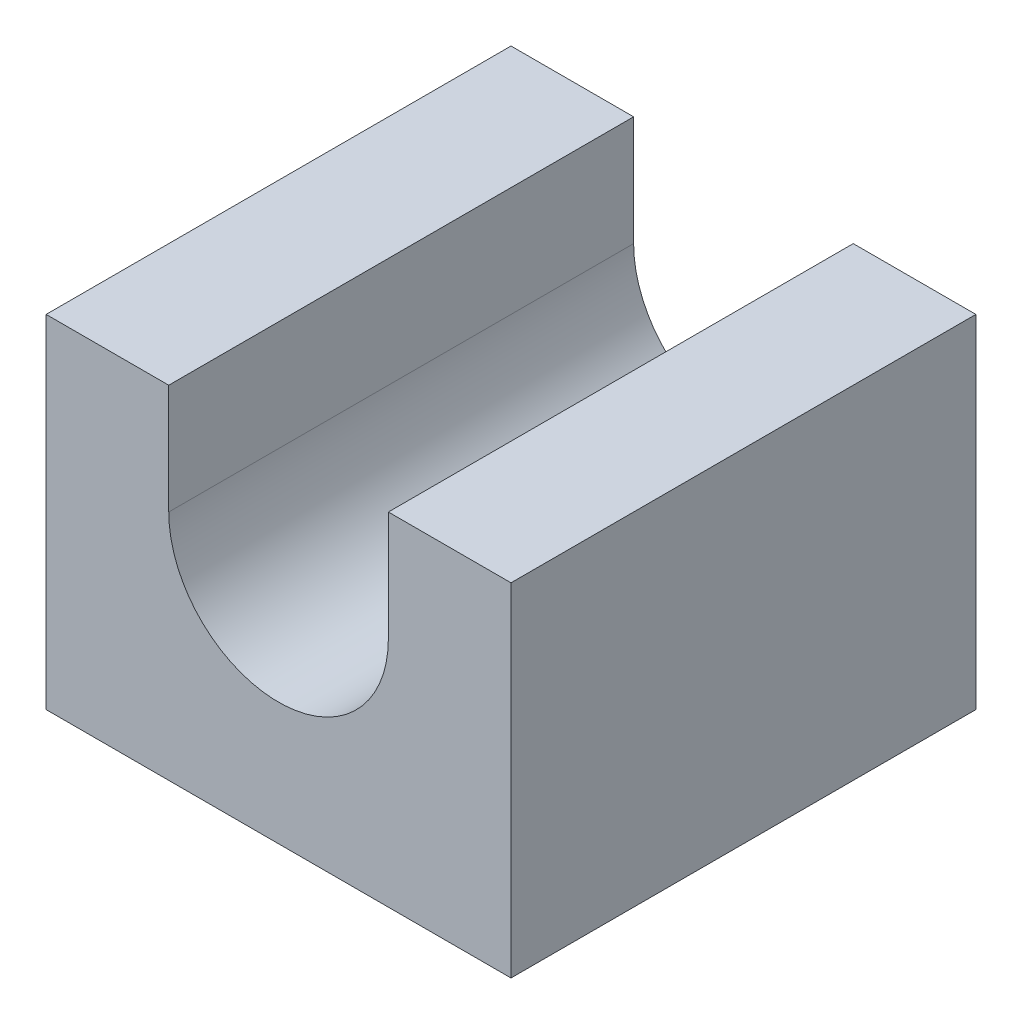
ISO-10303-21;
HEADER;
FILE_DESCRIPTION(('STEP AP214'),'2;1');
FILE_NAME('part.step','',(''),(''),'','','');
FILE_SCHEMA(('AUTOMOTIVE_DESIGN { 1 0 10303 214 1 1 1 1 }'));
ENDSEC;
DATA;
#1=APPLICATION_CONTEXT('core data for automotive mechanical design processes');
#2=APPLICATION_PROTOCOL_DEFINITION('international standard','automotive_design',2000,#1);
#3=PRODUCT_CONTEXT('',#1,'mechanical');
#4=PRODUCT('Part','Part','',(#3));
#5=PRODUCT_RELATED_PRODUCT_CATEGORY('part','',(#4));
#6=PRODUCT_DEFINITION_FORMATION('','',#4);
#7=PRODUCT_DEFINITION_CONTEXT('part definition',#1,'design');
#8=PRODUCT_DEFINITION('design','',#6,#7);
#9=PRODUCT_DEFINITION_SHAPE('','',#8);
#10=(LENGTH_UNIT() NAMED_UNIT(*) SI_UNIT(.MILLI.,.METRE.));
#11=(NAMED_UNIT(*) PLANE_ANGLE_UNIT() SI_UNIT($,.RADIAN.));
#12=(NAMED_UNIT(*) SI_UNIT($,.STERADIAN.) SOLID_ANGLE_UNIT());
#13=UNCERTAINTY_MEASURE_WITH_UNIT(LENGTH_MEASURE(1.E-05),#10,'distance_accuracy_value','');
#14=(GEOMETRIC_REPRESENTATION_CONTEXT(3) GLOBAL_UNCERTAINTY_ASSIGNED_CONTEXT((#13)) GLOBAL_UNIT_ASSIGNED_CONTEXT((#10,
#11,#12)) REPRESENTATION_CONTEXT('',''));
#15=CARTESIAN_POINT('',(0.,0.,0.));
#16=DIRECTION('',(0.,0.,1.));
#17=DIRECTION('',(1.,0.,0.));
#18=AXIS2_PLACEMENT_3D('',#15,#16,#17);
#19=CARTESIAN_POINT('',(15.875,15.875,31.75));
#20=DIRECTION('',(0.,0.,-1.));
#21=DIRECTION('',(-1.,0.,0.));
#22=AXIS2_PLACEMENT_3D('',#19,#20,#21);
#23=CYLINDRICAL_SURFACE('',#22,7.5);
#24=CARTESIAN_POINT('',(15.875,15.875,0.));
#25=DIRECTION('',(0.,0.,1.));
#26=DIRECTION('',(1.,0.,0.));
#27=AXIS2_PLACEMENT_3D('',#24,#25,#26);
#28=CIRCLE('',#27,7.5);
#29=CARTESIAN_POINT('',(8.375,15.875,0.));
#30=VERTEX_POINT('',#29);
#31=CARTESIAN_POINT('',(23.375,15.875,0.));
#32=VERTEX_POINT('',#31);
#33=EDGE_CURVE('E129',#30,#32,#28,.T.);
#34=ORIENTED_EDGE('',*,*,#33,.F.);
#35=DIRECTION('',(0.,0.,-1.));
#36=VECTOR('',#35,1.);
#37=CARTESIAN_POINT('',(8.375,15.875,31.75));
#38=LINE('',#37,#36);
#39=CARTESIAN_POINT('',(8.375,15.875,31.75));
#40=VERTEX_POINT('',#39);
#41=EDGE_CURVE('E11',#40,#30,#38,.T.);
#42=ORIENTED_EDGE('',*,*,#41,.F.);
#43=CARTESIAN_POINT('',(15.875,15.875,31.75));
#44=DIRECTION('',(0.,0.,1.));
#45=DIRECTION('',(1.,0.,0.));
#46=AXIS2_PLACEMENT_3D('',#43,#44,#45);
#47=CIRCLE('',#46,7.5);
#48=CARTESIAN_POINT('',(23.375,15.875,31.75));
#49=VERTEX_POINT('',#48);
#50=EDGE_CURVE('E147',#40,#49,#47,.T.);
#51=ORIENTED_EDGE('',*,*,#50,.T.);
#52=DIRECTION('',(0.,0.,-1.));
#53=VECTOR('',#52,1.);
#54=CARTESIAN_POINT('',(23.375,15.875,31.75));
#55=LINE('',#54,#53);
#56=EDGE_CURVE('E50',#49,#32,#55,.T.);
#57=ORIENTED_EDGE('',*,*,#56,.T.);
#58=EDGE_LOOP('',(#34,#42,#51,#57));
#59=FACE_BOUND('',#58,.T.);
#60=ADVANCED_FACE('F34',(#59),#23,.F.);
#61=CARTESIAN_POINT('',(8.375,0.,31.75));
#62=DIRECTION('',(-1.,0.,0.));
#63=DIRECTION('',(0.,0.,1.));
#64=AXIS2_PLACEMENT_3D('',#61,#62,#63);
#65=PLANE('',#64);
#66=DIRECTION('',(0.,1.,0.));
#67=VECTOR('',#66,1.);
#68=CARTESIAN_POINT('',(8.375,0.,0.));
#69=LINE('',#68,#67);
#70=CARTESIAN_POINT('',(8.375,23.375,0.));
#71=VERTEX_POINT('',#70);
#72=EDGE_CURVE('E131',#30,#71,#69,.T.);
#73=ORIENTED_EDGE('',*,*,#72,.T.);
#74=DIRECTION('',(0.,0.,-1.));
#75=VECTOR('',#74,1.);
#76=CARTESIAN_POINT('',(8.375,23.375,31.75));
#77=LINE('',#76,#75);
#78=CARTESIAN_POINT('',(8.375,23.375,31.75));
#79=VERTEX_POINT('',#78);
#80=EDGE_CURVE('E42',#79,#71,#77,.T.);
#81=ORIENTED_EDGE('',*,*,#80,.F.);
#82=DIRECTION('',(0.,1.,0.));
#83=VECTOR('',#82,1.);
#84=CARTESIAN_POINT('',(8.375,0.,31.75));
#85=LINE('',#84,#83);
#86=EDGE_CURVE('E173',#40,#79,#85,.T.);
#87=ORIENTED_EDGE('',*,*,#86,.F.);
#88=ORIENTED_EDGE('',*,*,#41,.T.);
#89=EDGE_LOOP('',(#73,#81,#87,#88));
#90=FACE_BOUND('',#89,.T.);
#91=ADVANCED_FACE('F188',(#90),#65,.F.);
#92=CARTESIAN_POINT('',(0.,23.375,31.75));
#93=DIRECTION('',(0.,-1.,0.));
#94=DIRECTION('',(0.,0.,-1.));
#95=AXIS2_PLACEMENT_3D('',#92,#93,#94);
#96=PLANE('',#95);
#97=DIRECTION('',(-1.,0.,0.));
#98=VECTOR('',#97,1.);
#99=CARTESIAN_POINT('',(0.,23.375,0.));
#100=LINE('',#99,#98);
#101=CARTESIAN_POINT('',(0.,23.375,0.));
#102=VERTEX_POINT('',#101);
#103=EDGE_CURVE('E133',#71,#102,#100,.T.);
#104=ORIENTED_EDGE('',*,*,#103,.T.);
#105=DIRECTION('',(0.,0.,-1.));
#106=VECTOR('',#105,1.);
#107=CARTESIAN_POINT('',(0.,23.375,31.75));
#108=LINE('',#107,#106);
#109=CARTESIAN_POINT('',(0.,23.375,31.75));
#110=VERTEX_POINT('',#109);
#111=EDGE_CURVE('E153',#110,#102,#108,.T.);
#112=ORIENTED_EDGE('',*,*,#111,.F.);
#113=DIRECTION('',(-1.,0.,0.));
#114=VECTOR('',#113,1.);
#115=CARTESIAN_POINT('',(0.,23.375,31.75));
#116=LINE('',#115,#114);
#117=EDGE_CURVE('E161',#79,#110,#116,.T.);
#118=ORIENTED_EDGE('',*,*,#117,.F.);
#119=ORIENTED_EDGE('',*,*,#80,.T.);
#120=EDGE_LOOP('',(#104,#112,#118,#119));
#121=FACE_BOUND('',#120,.T.);
#122=ADVANCED_FACE('F159',(#121),#96,.F.);
#123=CARTESIAN_POINT('',(0.,0.,31.75));
#124=DIRECTION('',(-1.,0.,0.));
#125=DIRECTION('',(0.,0.,1.));
#126=AXIS2_PLACEMENT_3D('',#123,#124,#125);
#127=PLANE('',#126);
#128=DIRECTION('',(0.,1.,0.));
#129=VECTOR('',#128,1.);
#130=CARTESIAN_POINT('',(0.,0.,0.));
#131=LINE('',#130,#129);
#132=CARTESIAN_POINT('',(0.,0.,0.));
#133=VERTEX_POINT('',#132);
#134=EDGE_CURVE('E136',#133,#102,#131,.T.);
#135=ORIENTED_EDGE('',*,*,#134,.F.);
#136=DIRECTION('',(0.,0.,-1.));
#137=VECTOR('',#136,1.);
#138=CARTESIAN_POINT('',(0.,0.,31.75));
#139=LINE('',#138,#137);
#140=CARTESIAN_POINT('',(0.,0.,31.75));
#141=VERTEX_POINT('',#140);
#142=EDGE_CURVE('E151',#141,#133,#139,.T.);
#143=ORIENTED_EDGE('',*,*,#142,.F.);
#144=DIRECTION('',(0.,1.,0.));
#145=VECTOR('',#144,1.);
#146=CARTESIAN_POINT('',(0.,0.,31.75));
#147=LINE('',#146,#145);
#148=EDGE_CURVE('E171',#141,#110,#147,.T.);
#149=ORIENTED_EDGE('',*,*,#148,.T.);
#150=ORIENTED_EDGE('',*,*,#111,.T.);
#151=EDGE_LOOP('',(#135,#143,#149,#150));
#152=FACE_BOUND('',#151,.T.);
#153=ADVANCED_FACE('F169',(#152),#127,.T.);
#154=CARTESIAN_POINT('',(0.,0.,31.75));
#155=DIRECTION('',(0.,1.,0.));
#156=DIRECTION('',(0.,0.,1.));
#157=AXIS2_PLACEMENT_3D('',#154,#155,#156);
#158=PLANE('',#157);
#159=DIRECTION('',(1.,0.,0.));
#160=VECTOR('',#159,1.);
#161=CARTESIAN_POINT('',(0.,0.,0.));
#162=LINE('',#161,#160);
#163=CARTESIAN_POINT('',(31.75,0.,0.));
#164=VERTEX_POINT('',#163);
#165=EDGE_CURVE('E139',#133,#164,#162,.T.);
#166=ORIENTED_EDGE('',*,*,#165,.T.);
#167=DIRECTION('',(0.,0.,-1.));
#168=VECTOR('',#167,1.);
#169=CARTESIAN_POINT('',(31.75,0.,31.75));
#170=LINE('',#169,#168);
#171=CARTESIAN_POINT('',(31.75,0.,31.75));
#172=VERTEX_POINT('',#171);
#173=EDGE_CURVE('E121',#172,#164,#170,.T.);
#174=ORIENTED_EDGE('',*,*,#173,.F.);
#175=DIRECTION('',(1.,0.,0.));
#176=VECTOR('',#175,1.);
#177=CARTESIAN_POINT('',(0.,0.,31.75));
#178=LINE('',#177,#176);
#179=EDGE_CURVE('E109',#141,#172,#178,.T.);
#180=ORIENTED_EDGE('',*,*,#179,.F.);
#181=ORIENTED_EDGE('',*,*,#142,.T.);
#182=EDGE_LOOP('',(#166,#174,#180,#181));
#183=FACE_BOUND('',#182,.T.);
#184=ADVANCED_FACE('F199',(#183),#158,.F.);
#185=CARTESIAN_POINT('',(31.75,0.,31.75));
#186=DIRECTION('',(-1.,0.,0.));
#187=DIRECTION('',(0.,0.,1.));
#188=AXIS2_PLACEMENT_3D('',#185,#186,#187);
#189=PLANE('',#188);
#190=DIRECTION('',(0.,1.,0.));
#191=VECTOR('',#190,1.);
#192=CARTESIAN_POINT('',(31.75,0.,0.));
#193=LINE('',#192,#191);
#194=CARTESIAN_POINT('',(31.75,23.375,0.));
#195=VERTEX_POINT('',#194);
#196=EDGE_CURVE('E118',#164,#195,#193,.T.);
#197=ORIENTED_EDGE('',*,*,#196,.T.);
#198=DIRECTION('',(0.,0.,-1.));
#199=VECTOR('',#198,1.);
#200=CARTESIAN_POINT('',(31.75,23.375,31.75));
#201=LINE('',#200,#199);
#202=CARTESIAN_POINT('',(31.75,23.375,31.75));
#203=VERTEX_POINT('',#202);
#204=EDGE_CURVE('E115',#203,#195,#201,.T.);
#205=ORIENTED_EDGE('',*,*,#204,.F.);
#206=DIRECTION('',(0.,1.,0.));
#207=VECTOR('',#206,1.);
#208=CARTESIAN_POINT('',(31.75,0.,31.75));
#209=LINE('',#208,#207);
#210=EDGE_CURVE('E100',#172,#203,#209,.T.);
#211=ORIENTED_EDGE('',*,*,#210,.F.);
#212=ORIENTED_EDGE('',*,*,#173,.T.);
#213=EDGE_LOOP('',(#197,#205,#211,#212));
#214=FACE_BOUND('',#213,.T.);
#215=ADVANCED_FACE('F116',(#214),#189,.F.);
#216=CARTESIAN_POINT('',(0.,23.375,31.75));
#217=DIRECTION('',(0.,1.,0.));
#218=DIRECTION('',(0.,0.,1.));
#219=AXIS2_PLACEMENT_3D('',#216,#217,#218);
#220=PLANE('',#219);
#221=DIRECTION('',(1.,0.,0.));
#222=VECTOR('',#221,1.);
#223=CARTESIAN_POINT('',(0.,23.375,0.));
#224=LINE('',#223,#222);
#225=CARTESIAN_POINT('',(23.375,23.375,0.));
#226=VERTEX_POINT('',#225);
#227=EDGE_CURVE('E142',#226,#195,#224,.T.);
#228=ORIENTED_EDGE('',*,*,#227,.F.);
#229=DIRECTION('',(0.,0.,-1.));
#230=VECTOR('',#229,1.);
#231=CARTESIAN_POINT('',(23.375,23.375,31.75));
#232=LINE('',#231,#230);
#233=CARTESIAN_POINT('',(23.375,23.375,31.75));
#234=VERTEX_POINT('',#233);
#235=EDGE_CURVE('E75',#234,#226,#232,.T.);
#236=ORIENTED_EDGE('',*,*,#235,.F.);
#237=DIRECTION('',(1.,0.,0.));
#238=VECTOR('',#237,1.);
#239=CARTESIAN_POINT('',(0.,23.375,31.75));
#240=LINE('',#239,#238);
#241=EDGE_CURVE('E106',#234,#203,#240,.T.);
#242=ORIENTED_EDGE('',*,*,#241,.T.);
#243=ORIENTED_EDGE('',*,*,#204,.T.);
#244=EDGE_LOOP('',(#228,#236,#242,#243));
#245=FACE_BOUND('',#244,.T.);
#246=ADVANCED_FACE('F123',(#245),#220,.T.);
#247=CARTESIAN_POINT('',(23.375,0.,31.75));
#248=DIRECTION('',(-1.,0.,0.));
#249=DIRECTION('',(0.,0.,1.));
#250=AXIS2_PLACEMENT_3D('',#247,#248,#249);
#251=PLANE('',#250);
#252=DIRECTION('',(0.,1.,0.));
#253=VECTOR('',#252,1.);
#254=CARTESIAN_POINT('',(23.375,0.,0.));
#255=LINE('',#254,#253);
#256=EDGE_CURVE('E144',#32,#226,#255,.T.);
#257=ORIENTED_EDGE('',*,*,#256,.F.);
#258=ORIENTED_EDGE('',*,*,#56,.F.);
#259=DIRECTION('',(0.,1.,0.));
#260=VECTOR('',#259,1.);
#261=CARTESIAN_POINT('',(23.375,0.,31.75));
#262=LINE('',#261,#260);
#263=EDGE_CURVE('E124',#49,#234,#262,.T.);
#264=ORIENTED_EDGE('',*,*,#263,.T.);
#265=ORIENTED_EDGE('',*,*,#235,.T.);
#266=EDGE_LOOP('',(#257,#258,#264,#265));
#267=FACE_BOUND('',#266,.T.);
#268=ADVANCED_FACE('F177',(#267),#251,.T.);
#269=CARTESIAN_POINT('',(0.,0.,31.75));
#270=DIRECTION('',(0.,0.,1.));
#271=DIRECTION('',(1.,0.,0.));
#272=AXIS2_PLACEMENT_3D('',#269,#270,#271);
#273=PLANE('',#272);
#274=ORIENTED_EDGE('',*,*,#50,.F.);
#275=ORIENTED_EDGE('',*,*,#86,.T.);
#276=ORIENTED_EDGE('',*,*,#117,.T.);
#277=ORIENTED_EDGE('',*,*,#148,.F.);
#278=ORIENTED_EDGE('',*,*,#179,.T.);
#279=ORIENTED_EDGE('',*,*,#210,.T.);
#280=ORIENTED_EDGE('',*,*,#241,.F.);
#281=ORIENTED_EDGE('',*,*,#263,.F.);
#282=EDGE_LOOP('',(#274,#275,#276,#277,#278,#279,#280,#281));
#283=FACE_BOUND('',#282,.T.);
#284=ADVANCED_FACE('F103',(#283),#273,.T.);
#285=CARTESIAN_POINT('',(0.,0.,0.));
#286=DIRECTION('',(0.,0.,1.));
#287=DIRECTION('',(1.,0.,0.));
#288=AXIS2_PLACEMENT_3D('',#285,#286,#287);
#289=PLANE('',#288);
#290=ORIENTED_EDGE('',*,*,#33,.T.);
#291=ORIENTED_EDGE('',*,*,#256,.T.);
#292=ORIENTED_EDGE('',*,*,#227,.T.);
#293=ORIENTED_EDGE('',*,*,#196,.F.);
#294=ORIENTED_EDGE('',*,*,#165,.F.);
#295=ORIENTED_EDGE('',*,*,#134,.T.);
#296=ORIENTED_EDGE('',*,*,#103,.F.);
#297=ORIENTED_EDGE('',*,*,#72,.F.);
#298=EDGE_LOOP('',(#290,#291,#292,#293,#294,#295,#296,#297));
#299=FACE_BOUND('',#298,.T.);
#300=ADVANCED_FACE('F165',(#299),#289,.F.);
#301=CLOSED_SHELL('',(#60,#91,#122,#153,#184,#215,#246,#268,#284,#300));
#302=MANIFOLD_SOLID_BREP('B2',#301);
#303=ADVANCED_BREP_SHAPE_REPRESENTATION('',(#18,#302),#14);
#304=SHAPE_DEFINITION_REPRESENTATION(#9,#303);
ENDSEC;
END-ISO-10303-21;
